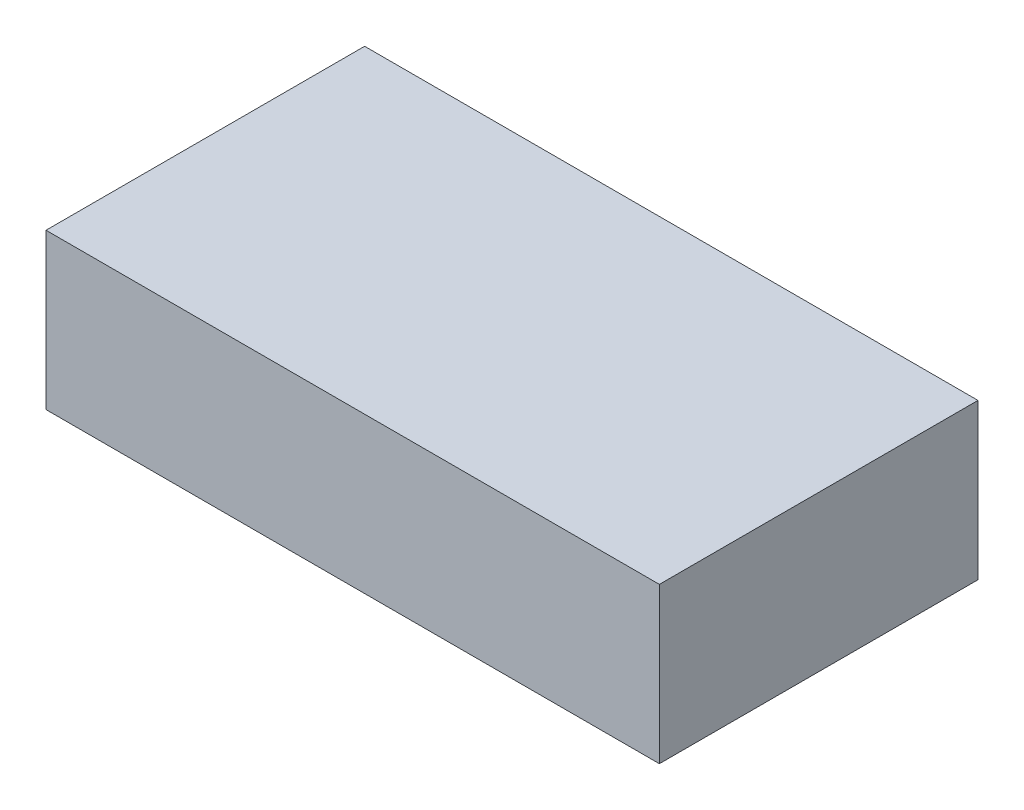
ISO-10303-21;
HEADER;
FILE_DESCRIPTION(('STEP AP214'),'2;1');
FILE_NAME('part.step','',(''),(''),'','','');
FILE_SCHEMA(('AUTOMOTIVE_DESIGN { 1 0 10303 214 1 1 1 1 }'));
ENDSEC;
DATA;
#1=APPLICATION_CONTEXT('core data for automotive mechanical design processes');
#2=APPLICATION_PROTOCOL_DEFINITION('international standard','automotive_design',2000,#1);
#3=PRODUCT_CONTEXT('',#1,'mechanical');
#4=PRODUCT('Part','Part','',(#3));
#5=PRODUCT_RELATED_PRODUCT_CATEGORY('part','',(#4));
#6=PRODUCT_DEFINITION_FORMATION('','',#4);
#7=PRODUCT_DEFINITION_CONTEXT('part definition',#1,'design');
#8=PRODUCT_DEFINITION('design','',#6,#7);
#9=PRODUCT_DEFINITION_SHAPE('','',#8);
#10=(LENGTH_UNIT() NAMED_UNIT(*) SI_UNIT(.MILLI.,.METRE.));
#11=(NAMED_UNIT(*) PLANE_ANGLE_UNIT() SI_UNIT($,.RADIAN.));
#12=(NAMED_UNIT(*) SI_UNIT($,.STERADIAN.) SOLID_ANGLE_UNIT());
#13=UNCERTAINTY_MEASURE_WITH_UNIT(LENGTH_MEASURE(1.E-05),#10,'distance_accuracy_value','');
#14=(GEOMETRIC_REPRESENTATION_CONTEXT(3) GLOBAL_UNCERTAINTY_ASSIGNED_CONTEXT((#13)) GLOBAL_UNIT_ASSIGNED_CONTEXT((#10,
#11,#12)) REPRESENTATION_CONTEXT('',''));
#15=CARTESIAN_POINT('',(0.,0.,0.));
#16=DIRECTION('',(0.,0.,1.));
#17=DIRECTION('',(1.,0.,0.));
#18=AXIS2_PLACEMENT_3D('',#15,#16,#17);
#19=CARTESIAN_POINT('',(0.,0.39,0.));
#20=DIRECTION('',(0.,1.,0.));
#21=DIRECTION('',(0.,0.,1.));
#22=AXIS2_PLACEMENT_3D('',#19,#20,#21);
#23=PLANE('',#22);
#24=DIRECTION('',(0.,0.,-1.));
#25=VECTOR('',#24,1.);
#26=CARTESIAN_POINT('',(0.77,0.39,0.4));
#27=LINE('',#26,#25);
#28=CARTESIAN_POINT('',(0.77,0.39,-0.4));
#29=VERTEX_POINT('',#28);
#30=CARTESIAN_POINT('',(0.77,0.39,0.4));
#31=VERTEX_POINT('',#30);
#32=EDGE_CURVE('E68',#29,#31,#27,.F.);
#33=ORIENTED_EDGE('',*,*,#32,.F.);
#34=DIRECTION('',(-1.,0.,0.));
#35=VECTOR('',#34,1.);
#36=CARTESIAN_POINT('',(0.77,0.39,-0.4));
#37=LINE('',#36,#35);
#38=CARTESIAN_POINT('',(-0.77,0.39,-0.4));
#39=VERTEX_POINT('',#38);
#40=EDGE_CURVE('E55',#39,#29,#37,.F.);
#41=ORIENTED_EDGE('',*,*,#40,.F.);
#42=DIRECTION('',(0.,0.,1.));
#43=VECTOR('',#42,1.);
#44=CARTESIAN_POINT('',(-0.77,0.39,-0.4));
#45=LINE('',#44,#43);
#46=CARTESIAN_POINT('',(-0.77,0.39,0.4));
#47=VERTEX_POINT('',#46);
#48=EDGE_CURVE('E20',#47,#39,#45,.F.);
#49=ORIENTED_EDGE('',*,*,#48,.F.);
#50=DIRECTION('',(1.,0.,0.));
#51=VECTOR('',#50,1.);
#52=CARTESIAN_POINT('',(-0.77,0.39,0.4));
#53=LINE('',#52,#51);
#54=EDGE_CURVE('E80',#31,#47,#53,.F.);
#55=ORIENTED_EDGE('',*,*,#54,.F.);
#56=EDGE_LOOP('',(#33,#41,#49,#55));
#57=FACE_BOUND('',#56,.T.);
#58=ADVANCED_FACE('F17',(#57),#23,.T.);
#59=CARTESIAN_POINT('',(-0.77,0.,-0.4));
#60=DIRECTION('',(-1.,0.,0.));
#61=DIRECTION('',(0.,0.,1.));
#62=AXIS2_PLACEMENT_3D('',#59,#60,#61);
#63=PLANE('',#62);
#64=ORIENTED_EDGE('',*,*,#48,.T.);
#65=DIRECTION('',(0.,1.,0.));
#66=VECTOR('',#65,1.);
#67=CARTESIAN_POINT('',(-0.77,0.,-0.4));
#68=LINE('',#67,#66);
#69=CARTESIAN_POINT('',(-0.77,0.,-0.4));
#70=VERTEX_POINT('',#69);
#71=EDGE_CURVE('E61',#70,#39,#68,.T.);
#72=ORIENTED_EDGE('',*,*,#71,.F.);
#73=DIRECTION('',(0.,0.,-1.));
#74=VECTOR('',#73,1.);
#75=CARTESIAN_POINT('',(-0.77,0.,0.));
#76=LINE('',#75,#74);
#77=CARTESIAN_POINT('',(-0.77,0.,0.4));
#78=VERTEX_POINT('',#77);
#79=EDGE_CURVE('E83',#78,#70,#76,.T.);
#80=ORIENTED_EDGE('',*,*,#79,.F.);
#81=DIRECTION('',(0.,1.,0.));
#82=VECTOR('',#81,1.);
#83=CARTESIAN_POINT('',(-0.77,0.,0.4));
#84=LINE('',#83,#82);
#85=EDGE_CURVE('E64',#47,#78,#84,.F.);
#86=ORIENTED_EDGE('',*,*,#85,.F.);
#87=EDGE_LOOP('',(#64,#72,#80,#86));
#88=FACE_BOUND('',#87,.T.);
#89=ADVANCED_FACE('F60',(#88),#63,.T.);
#90=CARTESIAN_POINT('',(0.77,0.,-0.4));
#91=DIRECTION('',(0.,0.,-1.));
#92=DIRECTION('',(-1.,0.,0.));
#93=AXIS2_PLACEMENT_3D('',#90,#91,#92);
#94=PLANE('',#93);
#95=ORIENTED_EDGE('',*,*,#40,.T.);
#96=DIRECTION('',(0.,1.,0.));
#97=VECTOR('',#96,1.);
#98=CARTESIAN_POINT('',(0.77,0.,-0.4));
#99=LINE('',#98,#97);
#100=CARTESIAN_POINT('',(0.77,0.,-0.4));
#101=VERTEX_POINT('',#100);
#102=EDGE_CURVE('E70',#101,#29,#99,.T.);
#103=ORIENTED_EDGE('',*,*,#102,.F.);
#104=DIRECTION('',(1.,0.,0.));
#105=VECTOR('',#104,1.);
#106=CARTESIAN_POINT('',(0.,0.,-0.4));
#107=LINE('',#106,#105);
#108=EDGE_CURVE('E74',#70,#101,#107,.T.);
#109=ORIENTED_EDGE('',*,*,#108,.F.);
#110=ORIENTED_EDGE('',*,*,#71,.T.);
#111=EDGE_LOOP('',(#95,#103,#109,#110));
#112=FACE_BOUND('',#111,.T.);
#113=ADVANCED_FACE('F72',(#112),#94,.T.);
#114=CARTESIAN_POINT('',(0.77,0.,0.4));
#115=DIRECTION('',(1.,0.,0.));
#116=DIRECTION('',(0.,0.,-1.));
#117=AXIS2_PLACEMENT_3D('',#114,#115,#116);
#118=PLANE('',#117);
#119=ORIENTED_EDGE('',*,*,#32,.T.);
#120=DIRECTION('',(0.,1.,0.));
#121=VECTOR('',#120,1.);
#122=CARTESIAN_POINT('',(0.77,0.,0.4));
#123=LINE('',#122,#121);
#124=CARTESIAN_POINT('',(0.77,0.,0.4));
#125=VERTEX_POINT('',#124);
#126=EDGE_CURVE('E35',#125,#31,#123,.T.);
#127=ORIENTED_EDGE('',*,*,#126,.F.);
#128=DIRECTION('',(0.,0.,-1.));
#129=VECTOR('',#128,1.);
#130=CARTESIAN_POINT('',(0.77,0.,0.));
#131=LINE('',#130,#129);
#132=EDGE_CURVE('E26',#101,#125,#131,.F.);
#133=ORIENTED_EDGE('',*,*,#132,.F.);
#134=ORIENTED_EDGE('',*,*,#102,.T.);
#135=EDGE_LOOP('',(#119,#127,#133,#134));
#136=FACE_BOUND('',#135,.T.);
#137=ADVANCED_FACE('F89',(#136),#118,.T.);
#138=CARTESIAN_POINT('',(-0.77,0.,0.4));
#139=DIRECTION('',(0.,0.,1.));
#140=DIRECTION('',(1.,0.,0.));
#141=AXIS2_PLACEMENT_3D('',#138,#139,#140);
#142=PLANE('',#141);
#143=ORIENTED_EDGE('',*,*,#54,.T.);
#144=ORIENTED_EDGE('',*,*,#85,.T.);
#145=DIRECTION('',(1.,0.,0.));
#146=VECTOR('',#145,1.);
#147=CARTESIAN_POINT('',(0.,0.,0.4));
#148=LINE('',#147,#146);
#149=EDGE_CURVE('E11',#125,#78,#148,.F.);
#150=ORIENTED_EDGE('',*,*,#149,.F.);
#151=ORIENTED_EDGE('',*,*,#126,.T.);
#152=EDGE_LOOP('',(#143,#144,#150,#151));
#153=FACE_BOUND('',#152,.T.);
#154=ADVANCED_FACE('F91',(#153),#142,.T.);
#155=CARTESIAN_POINT('',(0.,0.,0.));
#156=DIRECTION('',(0.,-1.,0.));
#157=DIRECTION('',(0.,0.,-1.));
#158=AXIS2_PLACEMENT_3D('',#155,#156,#157);
#159=PLANE('',#158);
#160=ORIENTED_EDGE('',*,*,#132,.T.);
#161=ORIENTED_EDGE('',*,*,#149,.T.);
#162=ORIENTED_EDGE('',*,*,#79,.T.);
#163=ORIENTED_EDGE('',*,*,#108,.T.);
#164=EDGE_LOOP('',(#160,#161,#162,#163));
#165=FACE_BOUND('',#164,.T.);
#166=ADVANCED_FACE('F88',(#165),#159,.T.);
#167=CLOSED_SHELL('',(#58,#89,#113,#137,#154,#166));
#168=MANIFOLD_SOLID_BREP('B1',#167);
#169=ADVANCED_BREP_SHAPE_REPRESENTATION('',(#18,#168),#14);
#170=SHAPE_DEFINITION_REPRESENTATION(#9,#169);
ENDSEC;
END-ISO-10303-21;
